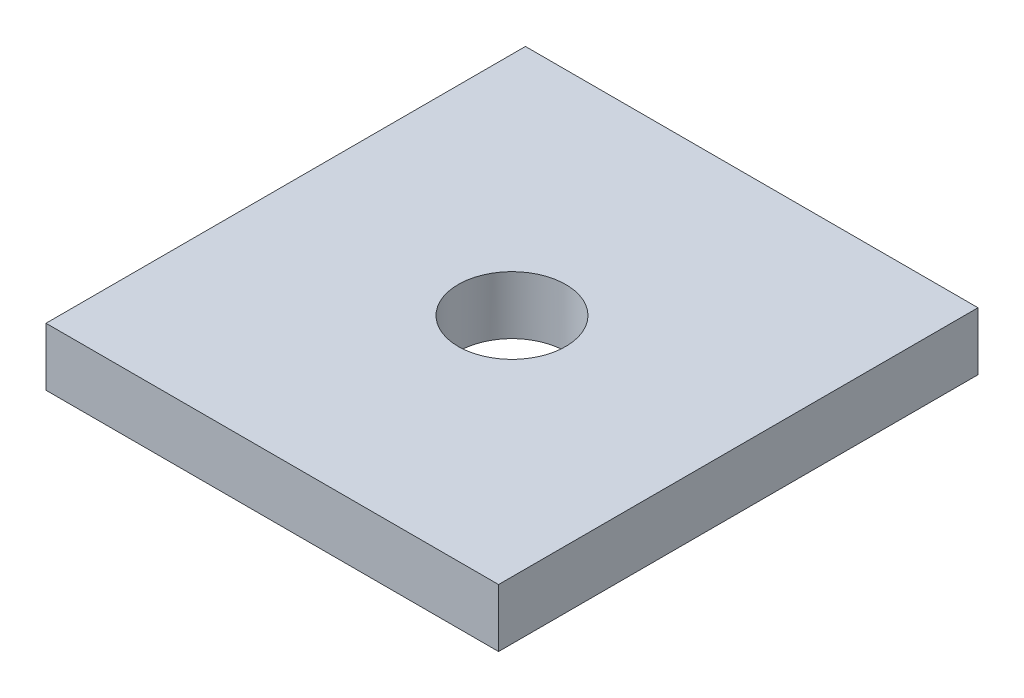
ISO-10303-21;
HEADER;
FILE_DESCRIPTION(('STEP AP214'),'2;1');
FILE_NAME('part.step','',(''),(''),'','','');
FILE_SCHEMA(('AUTOMOTIVE_DESIGN { 1 0 10303 214 1 1 1 1 }'));
ENDSEC;
DATA;
#1=APPLICATION_CONTEXT('core data for automotive mechanical design processes');
#2=APPLICATION_PROTOCOL_DEFINITION('international standard','automotive_design',2000,#1);
#3=PRODUCT_CONTEXT('',#1,'mechanical');
#4=PRODUCT('Part','Part','',(#3));
#5=PRODUCT_RELATED_PRODUCT_CATEGORY('part','',(#4));
#6=PRODUCT_DEFINITION_FORMATION('','',#4);
#7=PRODUCT_DEFINITION_CONTEXT('part definition',#1,'design');
#8=PRODUCT_DEFINITION('design','',#6,#7);
#9=PRODUCT_DEFINITION_SHAPE('','',#8);
#10=(LENGTH_UNIT() NAMED_UNIT(*) SI_UNIT(.MILLI.,.METRE.));
#11=(NAMED_UNIT(*) PLANE_ANGLE_UNIT() SI_UNIT($,.RADIAN.));
#12=(NAMED_UNIT(*) SI_UNIT($,.STERADIAN.) SOLID_ANGLE_UNIT());
#13=UNCERTAINTY_MEASURE_WITH_UNIT(LENGTH_MEASURE(1.E-05),#10,'distance_accuracy_value','');
#14=(GEOMETRIC_REPRESENTATION_CONTEXT(3) GLOBAL_UNCERTAINTY_ASSIGNED_CONTEXT((#13)) GLOBAL_UNIT_ASSIGNED_CONTEXT((#10,
#11,#12)) REPRESENTATION_CONTEXT('',''));
#15=CARTESIAN_POINT('',(0.,0.,0.));
#16=DIRECTION('',(0.,0.,1.));
#17=DIRECTION('',(1.,0.,0.));
#18=AXIS2_PLACEMENT_3D('',#15,#16,#17);
#19=CARTESIAN_POINT('',(26.7335,6.858,28.321));
#20=DIRECTION('',(-1.,0.,0.));
#21=DIRECTION('',(0.,0.,1.));
#22=AXIS2_PLACEMENT_3D('',#19,#20,#21);
#23=PLANE('',#22);
#24=DIRECTION('',(0.,0.,-1.));
#25=VECTOR('',#24,1.);
#26=CARTESIAN_POINT('',(26.7335,0.,28.321));
#27=LINE('',#26,#25);
#28=CARTESIAN_POINT('',(26.7335,0.,28.321));
#29=VERTEX_POINT('',#28);
#30=CARTESIAN_POINT('',(26.7335,0.,-28.321));
#31=VERTEX_POINT('',#30);
#32=EDGE_CURVE('E99',#29,#31,#27,.T.);
#33=ORIENTED_EDGE('',*,*,#32,.T.);
#34=DIRECTION('',(0.,-1.,0.));
#35=VECTOR('',#34,1.);
#36=CARTESIAN_POINT('',(26.7335,6.858,-28.321));
#37=LINE('',#36,#35);
#38=CARTESIAN_POINT('',(26.7335,6.858,-28.321));
#39=VERTEX_POINT('',#38);
#40=EDGE_CURVE('E11',#39,#31,#37,.T.);
#41=ORIENTED_EDGE('',*,*,#40,.F.);
#42=DIRECTION('',(0.,0.,-1.));
#43=VECTOR('',#42,1.);
#44=CARTESIAN_POINT('',(26.7335,6.858,28.321));
#45=LINE('',#44,#43);
#46=CARTESIAN_POINT('',(26.7335,6.858,28.321));
#47=VERTEX_POINT('',#46);
#48=EDGE_CURVE('E86',#47,#39,#45,.T.);
#49=ORIENTED_EDGE('',*,*,#48,.F.);
#50=DIRECTION('',(0.,-1.,0.));
#51=VECTOR('',#50,1.);
#52=CARTESIAN_POINT('',(26.7335,6.858,28.321));
#53=LINE('',#52,#51);
#54=EDGE_CURVE('E95',#47,#29,#53,.T.);
#55=ORIENTED_EDGE('',*,*,#54,.T.);
#56=EDGE_LOOP('',(#33,#41,#49,#55));
#57=FACE_BOUND('',#56,.T.);
#58=ADVANCED_FACE('F34',(#57),#23,.F.);
#59=CARTESIAN_POINT('',(-26.7335,6.858,-28.321));
#60=DIRECTION('',(0.,0.,1.));
#61=DIRECTION('',(1.,0.,0.));
#62=AXIS2_PLACEMENT_3D('',#59,#60,#61);
#63=PLANE('',#62);
#64=DIRECTION('',(-1.,0.,0.));
#65=VECTOR('',#64,1.);
#66=CARTESIAN_POINT('',(-26.7335,0.,-28.321));
#67=LINE('',#66,#65);
#68=CARTESIAN_POINT('',(-26.7335,0.,-28.321));
#69=VERTEX_POINT('',#68);
#70=EDGE_CURVE('E90',#31,#69,#67,.T.);
#71=ORIENTED_EDGE('',*,*,#70,.T.);
#72=DIRECTION('',(0.,-1.,0.));
#73=VECTOR('',#72,1.);
#74=CARTESIAN_POINT('',(-26.7335,6.858,-28.321));
#75=LINE('',#74,#73);
#76=CARTESIAN_POINT('',(-26.7335,6.858,-28.321));
#77=VERTEX_POINT('',#76);
#78=EDGE_CURVE('E43',#77,#69,#75,.T.);
#79=ORIENTED_EDGE('',*,*,#78,.F.);
#80=DIRECTION('',(-1.,0.,0.));
#81=VECTOR('',#80,1.);
#82=CARTESIAN_POINT('',(-26.7335,6.858,-28.321));
#83=LINE('',#82,#81);
#84=EDGE_CURVE('E81',#39,#77,#83,.T.);
#85=ORIENTED_EDGE('',*,*,#84,.F.);
#86=ORIENTED_EDGE('',*,*,#40,.T.);
#87=EDGE_LOOP('',(#71,#79,#85,#86));
#88=FACE_BOUND('',#87,.T.);
#89=ADVANCED_FACE('F89',(#88),#63,.F.);
#90=CARTESIAN_POINT('',(-26.7335,6.858,28.321));
#91=DIRECTION('',(1.,0.,0.));
#92=DIRECTION('',(0.,0.,-1.));
#93=AXIS2_PLACEMENT_3D('',#90,#91,#92);
#94=PLANE('',#93);
#95=DIRECTION('',(0.,0.,1.));
#96=VECTOR('',#95,1.);
#97=CARTESIAN_POINT('',(-26.7335,0.,28.321));
#98=LINE('',#97,#96);
#99=CARTESIAN_POINT('',(-26.7335,0.,28.321));
#100=VERTEX_POINT('',#99);
#101=EDGE_CURVE('E68',#69,#100,#98,.T.);
#102=ORIENTED_EDGE('',*,*,#101,.T.);
#103=DIRECTION('',(0.,-1.,0.));
#104=VECTOR('',#103,1.);
#105=CARTESIAN_POINT('',(-26.7335,6.858,28.321));
#106=LINE('',#105,#104);
#107=CARTESIAN_POINT('',(-26.7335,6.858,28.321));
#108=VERTEX_POINT('',#107);
#109=EDGE_CURVE('E91',#108,#100,#106,.T.);
#110=ORIENTED_EDGE('',*,*,#109,.F.);
#111=DIRECTION('',(0.,0.,1.));
#112=VECTOR('',#111,1.);
#113=CARTESIAN_POINT('',(-26.7335,6.858,28.321));
#114=LINE('',#113,#112);
#115=EDGE_CURVE('E84',#77,#108,#114,.T.);
#116=ORIENTED_EDGE('',*,*,#115,.F.);
#117=ORIENTED_EDGE('',*,*,#78,.T.);
#118=EDGE_LOOP('',(#102,#110,#116,#117));
#119=FACE_BOUND('',#118,.T.);
#120=ADVANCED_FACE('F93',(#119),#94,.F.);
#121=CARTESIAN_POINT('',(-26.7335,6.858,28.321));
#122=DIRECTION('',(0.,0.,-1.));
#123=DIRECTION('',(-1.,0.,0.));
#124=AXIS2_PLACEMENT_3D('',#121,#122,#123);
#125=PLANE('',#124);
#126=DIRECTION('',(1.,0.,0.));
#127=VECTOR('',#126,1.);
#128=CARTESIAN_POINT('',(-26.7335,0.,28.321));
#129=LINE('',#128,#127);
#130=EDGE_CURVE('E74',#100,#29,#129,.T.);
#131=ORIENTED_EDGE('',*,*,#130,.T.);
#132=ORIENTED_EDGE('',*,*,#54,.F.);
#133=DIRECTION('',(1.,0.,0.));
#134=VECTOR('',#133,1.);
#135=CARTESIAN_POINT('',(-26.7335,6.858,28.321));
#136=LINE('',#135,#134);
#137=EDGE_CURVE('E51',#108,#47,#136,.T.);
#138=ORIENTED_EDGE('',*,*,#137,.F.);
#139=ORIENTED_EDGE('',*,*,#109,.T.);
#140=EDGE_LOOP('',(#131,#132,#138,#139));
#141=FACE_BOUND('',#140,.T.);
#142=ADVANCED_FACE('F106',(#141),#125,.F.);
#143=CARTESIAN_POINT('',(0.,6.858,0.));
#144=DIRECTION('',(0.,-1.,0.));
#145=DIRECTION('',(0.,0.,-1.));
#146=AXIS2_PLACEMENT_3D('',#143,#144,#145);
#147=PLANE('',#146);
#148=CARTESIAN_POINT('',(0.,6.858,0.));
#149=DIRECTION('',(0.,1.,0.));
#150=DIRECTION('',(0.,0.,1.));
#151=AXIS2_PLACEMENT_3D('',#148,#149,#150);
#152=CIRCLE('',#151,6.35);
#153=CARTESIAN_POINT('',(0.,6.858,6.35));
#154=VERTEX_POINT('',#153);
#155=EDGE_CURVE('E112',#154,#154,#152,.T.);
#156=ORIENTED_EDGE('',*,*,#155,.F.);
#157=EDGE_LOOP('',(#156));
#158=FACE_BOUND('',#157,.T.);
#159=ORIENTED_EDGE('',*,*,#48,.T.);
#160=ORIENTED_EDGE('',*,*,#84,.T.);
#161=ORIENTED_EDGE('',*,*,#115,.T.);
#162=ORIENTED_EDGE('',*,*,#137,.T.);
#163=EDGE_LOOP('',(#159,#160,#161,#162));
#164=FACE_BOUND('',#163,.T.);
#165=ADVANCED_FACE('F82',(#158,#164),#147,.F.);
#166=CARTESIAN_POINT('',(0.,0.,0.));
#167=DIRECTION('',(0.,-1.,0.));
#168=DIRECTION('',(0.,0.,-1.));
#169=AXIS2_PLACEMENT_3D('',#166,#167,#168);
#170=PLANE('',#169);
#171=CARTESIAN_POINT('',(0.,0.,0.));
#172=DIRECTION('',(0.,-1.,0.));
#173=DIRECTION('',(0.,0.,-1.));
#174=AXIS2_PLACEMENT_3D('',#171,#172,#173);
#175=CIRCLE('',#174,6.35);
#176=CARTESIAN_POINT('',(0.,0.,-6.35));
#177=VERTEX_POINT('',#176);
#178=EDGE_CURVE('E37',#177,#177,#175,.T.);
#179=ORIENTED_EDGE('',*,*,#178,.F.);
#180=EDGE_LOOP('',(#179));
#181=FACE_BOUND('',#180,.T.);
#182=ORIENTED_EDGE('',*,*,#32,.F.);
#183=ORIENTED_EDGE('',*,*,#130,.F.);
#184=ORIENTED_EDGE('',*,*,#101,.F.);
#185=ORIENTED_EDGE('',*,*,#70,.F.);
#186=EDGE_LOOP('',(#182,#183,#184,#185));
#187=FACE_BOUND('',#186,.T.);
#188=ADVANCED_FACE('F109',(#181,#187),#170,.T.);
#189=CARTESIAN_POINT('',(0.,-18.542,0.));
#190=DIRECTION('',(0.,1.,0.));
#191=DIRECTION('',(0.,0.,1.));
#192=AXIS2_PLACEMENT_3D('',#189,#190,#191);
#193=CYLINDRICAL_SURFACE('',#192,6.35);
#194=ORIENTED_EDGE('',*,*,#178,.T.);
#195=EDGE_LOOP('',(#194));
#196=FACE_BOUND('',#195,.T.);
#197=ORIENTED_EDGE('',*,*,#155,.T.);
#198=EDGE_LOOP('',(#197));
#199=FACE_BOUND('',#198,.T.);
#200=ADVANCED_FACE('F119',(#196,#199),#193,.F.);
#201=CLOSED_SHELL('',(#58,#89,#120,#142,#165,#188,#200));
#202=MANIFOLD_SOLID_BREP('B2',#201);
#203=ADVANCED_BREP_SHAPE_REPRESENTATION('',(#18,#202),#14);
#204=SHAPE_DEFINITION_REPRESENTATION(#9,#203);
ENDSEC;
END-ISO-10303-21;
